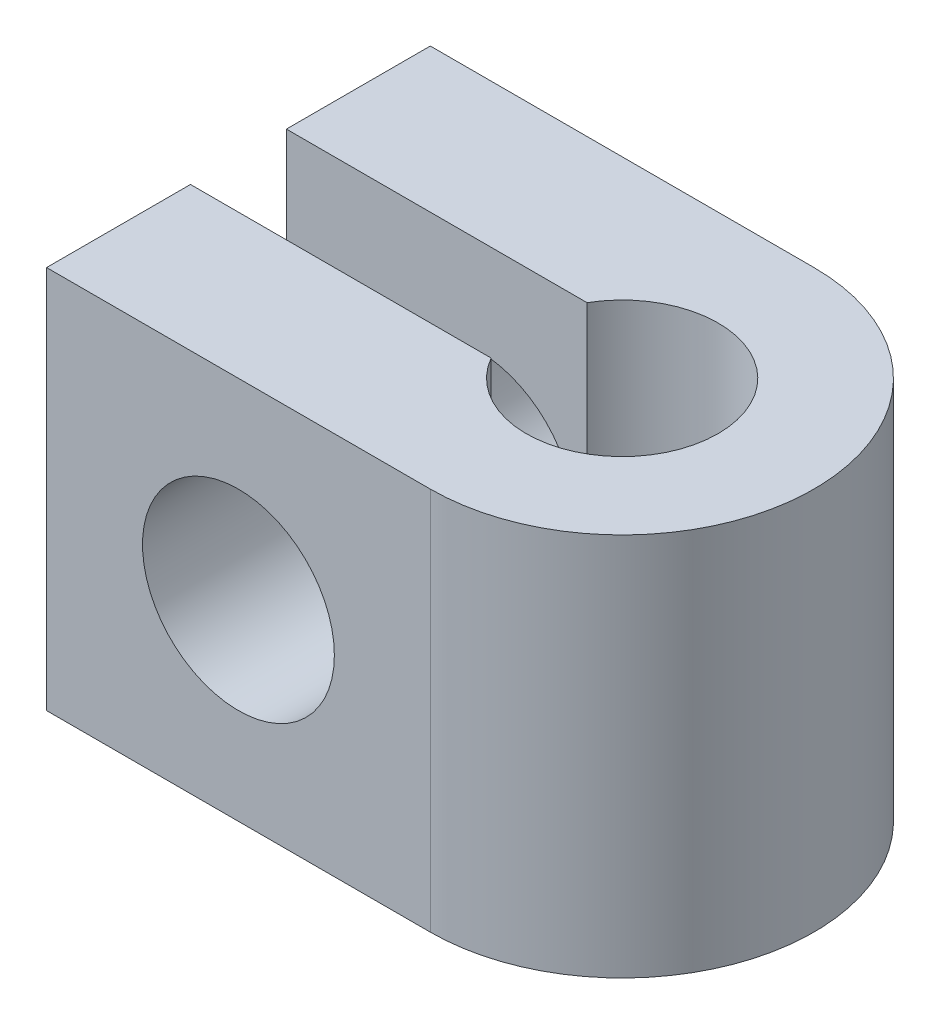
ISO-10303-21;
HEADER;
FILE_DESCRIPTION(('STEP AP214'),'2;1');
FILE_NAME('part.step','',(''),(''),'','','');
FILE_SCHEMA(('AUTOMOTIVE_DESIGN { 1 0 10303 214 1 1 1 1 }'));
ENDSEC;
DATA;
#1=APPLICATION_CONTEXT('core data for automotive mechanical design processes');
#2=APPLICATION_PROTOCOL_DEFINITION('international standard','automotive_design',2000,#1);
#3=PRODUCT_CONTEXT('',#1,'mechanical');
#4=PRODUCT('Part','Part','',(#3));
#5=PRODUCT_RELATED_PRODUCT_CATEGORY('part','',(#4));
#6=PRODUCT_DEFINITION_FORMATION('','',#4);
#7=PRODUCT_DEFINITION_CONTEXT('part definition',#1,'design');
#8=PRODUCT_DEFINITION('design','',#6,#7);
#9=PRODUCT_DEFINITION_SHAPE('','',#8);
#10=(LENGTH_UNIT() NAMED_UNIT(*) SI_UNIT(.MILLI.,.METRE.));
#11=(NAMED_UNIT(*) PLANE_ANGLE_UNIT() SI_UNIT($,.RADIAN.));
#12=(NAMED_UNIT(*) SI_UNIT($,.STERADIAN.) SOLID_ANGLE_UNIT());
#13=UNCERTAINTY_MEASURE_WITH_UNIT(LENGTH_MEASURE(1.E-05),#10,'distance_accuracy_value','');
#14=(GEOMETRIC_REPRESENTATION_CONTEXT(3) GLOBAL_UNCERTAINTY_ASSIGNED_CONTEXT((#13)) GLOBAL_UNIT_ASSIGNED_CONTEXT((#10,
#11,#12)) REPRESENTATION_CONTEXT('',''));
#15=CARTESIAN_POINT('',(0.,0.,0.));
#16=DIRECTION('',(0.,0.,1.));
#17=DIRECTION('',(1.,0.,0.));
#18=AXIS2_PLACEMENT_3D('',#15,#16,#17);
#19=CARTESIAN_POINT('',(0.,12.7,6.35));
#20=DIRECTION('',(0.,-1.,0.));
#21=DIRECTION('',(0.,0.,-1.));
#22=AXIS2_PLACEMENT_3D('',#19,#20,#21);
#23=CYLINDRICAL_SURFACE('',#22,6.35);
#24=CARTESIAN_POINT('',(0.,0.,6.35));
#25=DIRECTION('',(0.,1.,0.));
#26=DIRECTION('',(0.,0.,-1.));
#27=AXIS2_PLACEMENT_3D('',#24,#25,#26);
#28=CIRCLE('',#27,6.35);
#29=CARTESIAN_POINT('',(0.,0.,12.7));
#30=VERTEX_POINT('',#29);
#31=CARTESIAN_POINT('',(0.,0.,0.));
#32=VERTEX_POINT('',#31);
#33=EDGE_CURVE('E126',#30,#32,#28,.T.);
#34=ORIENTED_EDGE('',*,*,#33,.T.);
#35=DIRECTION('',(0.,-1.,0.));
#36=VECTOR('',#35,1.);
#37=CARTESIAN_POINT('',(0.,12.7,0.));
#38=LINE('',#37,#36);
#39=CARTESIAN_POINT('',(0.,12.7,0.));
#40=VERTEX_POINT('',#39);
#41=EDGE_CURVE('E11',#40,#32,#38,.T.);
#42=ORIENTED_EDGE('',*,*,#41,.F.);
#43=CARTESIAN_POINT('',(0.,12.7,6.35));
#44=DIRECTION('',(0.,1.,0.));
#45=DIRECTION('',(0.,0.,-1.));
#46=AXIS2_PLACEMENT_3D('',#43,#44,#45);
#47=CIRCLE('',#46,6.35);
#48=CARTESIAN_POINT('',(0.,12.7,12.7));
#49=VERTEX_POINT('',#48);
#50=EDGE_CURVE('E141',#49,#40,#47,.T.);
#51=ORIENTED_EDGE('',*,*,#50,.F.);
#52=DIRECTION('',(0.,-1.,0.));
#53=VECTOR('',#52,1.);
#54=CARTESIAN_POINT('',(0.,12.7,12.7));
#55=LINE('',#54,#53);
#56=EDGE_CURVE('E122',#49,#30,#55,.T.);
#57=ORIENTED_EDGE('',*,*,#56,.T.);
#58=EDGE_LOOP('',(#34,#42,#51,#57));
#59=FACE_BOUND('',#58,.T.);
#60=ADVANCED_FACE('F30',(#59),#23,.T.);
#61=CARTESIAN_POINT('',(0.,12.7,0.));
#62=DIRECTION('',(0.,0.,1.));
#63=DIRECTION('',(1.,0.,0.));
#64=AXIS2_PLACEMENT_3D('',#61,#62,#63);
#65=PLANE('',#64);
#66=CARTESIAN_POINT('',(-6.35,6.35,0.));
#67=DIRECTION('',(0.,0.,1.));
#68=DIRECTION('',(1.,0.,0.));
#69=AXIS2_PLACEMENT_3D('',#66,#67,#68);
#70=CIRCLE('',#69,3.175);
#71=CARTESIAN_POINT('',(-3.175,6.35,0.));
#72=VERTEX_POINT('',#71);
#73=EDGE_CURVE('E179',#72,#72,#70,.T.);
#74=ORIENTED_EDGE('',*,*,#73,.T.);
#75=EDGE_LOOP('',(#74));
#76=FACE_BOUND('',#75,.T.);
#77=DIRECTION('',(-1.,0.,0.));
#78=VECTOR('',#77,1.);
#79=CARTESIAN_POINT('',(0.,0.,0.));
#80=LINE('',#79,#78);
#81=CARTESIAN_POINT('',(-12.7,0.,0.));
#82=VERTEX_POINT('',#81);
#83=EDGE_CURVE('E129',#32,#82,#80,.T.);
#84=ORIENTED_EDGE('',*,*,#83,.T.);
#85=DIRECTION('',(0.,-1.,0.));
#86=VECTOR('',#85,1.);
#87=CARTESIAN_POINT('',(-12.7,12.7,0.));
#88=LINE('',#87,#86);
#89=CARTESIAN_POINT('',(-12.7,12.7,0.));
#90=VERTEX_POINT('',#89);
#91=EDGE_CURVE('E38',#90,#82,#88,.T.);
#92=ORIENTED_EDGE('',*,*,#91,.F.);
#93=DIRECTION('',(-1.,0.,0.));
#94=VECTOR('',#93,1.);
#95=CARTESIAN_POINT('',(0.,12.7,0.));
#96=LINE('',#95,#94);
#97=EDGE_CURVE('E89',#40,#90,#96,.T.);
#98=ORIENTED_EDGE('',*,*,#97,.F.);
#99=ORIENTED_EDGE('',*,*,#41,.T.);
#100=EDGE_LOOP('',(#84,#92,#98,#99));
#101=FACE_BOUND('',#100,.T.);
#102=ADVANCED_FACE('F186',(#76,#101),#65,.F.);
#103=CARTESIAN_POINT('',(-12.7,12.7,0.));
#104=DIRECTION('',(1.,0.,0.));
#105=DIRECTION('',(0.,0.,-1.));
#106=AXIS2_PLACEMENT_3D('',#103,#104,#105);
#107=PLANE('',#106);
#108=DIRECTION('',(0.,0.,1.));
#109=VECTOR('',#108,1.);
#110=CARTESIAN_POINT('',(-12.7,0.,0.));
#111=LINE('',#110,#109);
#112=CARTESIAN_POINT('',(-12.7,0.,4.7625));
#113=VERTEX_POINT('',#112);
#114=EDGE_CURVE('E132',#82,#113,#111,.T.);
#115=ORIENTED_EDGE('',*,*,#114,.T.);
#116=DIRECTION('',(0.,-1.,0.));
#117=VECTOR('',#116,1.);
#118=CARTESIAN_POINT('',(-12.7,12.7,4.7625));
#119=LINE('',#118,#117);
#120=CARTESIAN_POINT('',(-12.7,12.7,4.7625));
#121=VERTEX_POINT('',#120);
#122=EDGE_CURVE('E148',#121,#113,#119,.T.);
#123=ORIENTED_EDGE('',*,*,#122,.F.);
#124=DIRECTION('',(0.,0.,1.));
#125=VECTOR('',#124,1.);
#126=CARTESIAN_POINT('',(-12.7,12.7,0.));
#127=LINE('',#126,#125);
#128=EDGE_CURVE('E156',#90,#121,#127,.T.);
#129=ORIENTED_EDGE('',*,*,#128,.F.);
#130=ORIENTED_EDGE('',*,*,#91,.T.);
#131=EDGE_LOOP('',(#115,#123,#129,#130));
#132=FACE_BOUND('',#131,.T.);
#133=ADVANCED_FACE('F154',(#132),#107,.F.);
#134=CARTESIAN_POINT('',(-12.7,12.7,4.7625));
#135=DIRECTION('',(0.,0.,-1.));
#136=DIRECTION('',(-1.,0.,0.));
#137=AXIS2_PLACEMENT_3D('',#134,#135,#136);
#138=PLANE('',#137);
#139=CARTESIAN_POINT('',(-6.35,6.35,4.7625));
#140=DIRECTION('',(0.,0.,-1.));
#141=DIRECTION('',(-1.,0.,0.));
#142=AXIS2_PLACEMENT_3D('',#139,#140,#141);
#143=CIRCLE('',#142,3.175);
#144=CARTESIAN_POINT('',(-9.525,6.35,4.7625));
#145=VERTEX_POINT('',#144);
#146=EDGE_CURVE('E130',#145,#145,#143,.T.);
#147=ORIENTED_EDGE('',*,*,#146,.T.);
#148=EDGE_LOOP('',(#147));
#149=FACE_BOUND('',#148,.T.);
#150=DIRECTION('',(1.,0.,0.));
#151=VECTOR('',#150,1.);
#152=CARTESIAN_POINT('',(-12.7,0.,4.7625));
#153=LINE('',#152,#151);
#154=CARTESIAN_POINT('',(-2.74963065701559,0.,4.7625));
#155=VERTEX_POINT('',#154);
#156=EDGE_CURVE('E134',#113,#155,#153,.T.);
#157=ORIENTED_EDGE('',*,*,#156,.T.);
#158=DIRECTION('',(0.,-1.,0.));
#159=VECTOR('',#158,1.);
#160=CARTESIAN_POINT('',(-2.74963065701559,12.7,4.7625));
#161=LINE('',#160,#159);
#162=CARTESIAN_POINT('',(-2.74963065701559,12.7,4.7625));
#163=VERTEX_POINT('',#162);
#164=EDGE_CURVE('E145',#163,#155,#161,.T.);
#165=ORIENTED_EDGE('',*,*,#164,.F.);
#166=DIRECTION('',(1.,0.,0.));
#167=VECTOR('',#166,1.);
#168=CARTESIAN_POINT('',(-12.7,12.7,4.7625));
#169=LINE('',#168,#167);
#170=EDGE_CURVE('E168',#121,#163,#169,.T.);
#171=ORIENTED_EDGE('',*,*,#170,.F.);
#172=ORIENTED_EDGE('',*,*,#122,.T.);
#173=EDGE_LOOP('',(#157,#165,#171,#172));
#174=FACE_BOUND('',#173,.T.);
#175=ADVANCED_FACE('F164',(#149,#174),#138,.F.);
#176=CARTESIAN_POINT('',(0.,12.7,6.35));
#177=DIRECTION('',(0.,-1.,0.));
#178=DIRECTION('',(0.,0.,-1.));
#179=AXIS2_PLACEMENT_3D('',#176,#177,#178);
#180=CYLINDRICAL_SURFACE('',#179,3.175);
#181=CARTESIAN_POINT('',(0.,0.,6.35));
#182=DIRECTION('',(0.,-1.,0.));
#183=DIRECTION('',(0.,0.,-1.));
#184=AXIS2_PLACEMENT_3D('',#181,#182,#183);
#185=CIRCLE('',#184,3.175);
#186=CARTESIAN_POINT('',(-2.74963065701559,0.,7.9375));
#187=VERTEX_POINT('',#186);
#188=EDGE_CURVE('E136',#155,#187,#185,.T.);
#189=ORIENTED_EDGE('',*,*,#188,.T.);
#190=DIRECTION('',(0.,-1.,0.));
#191=VECTOR('',#190,1.);
#192=CARTESIAN_POINT('',(-2.74963065701559,12.7,7.9375));
#193=LINE('',#192,#191);
#194=CARTESIAN_POINT('',(-2.74963065701559,12.7,7.9375));
#195=VERTEX_POINT('',#194);
#196=EDGE_CURVE('E117',#195,#187,#193,.T.);
#197=ORIENTED_EDGE('',*,*,#196,.F.);
#198=CARTESIAN_POINT('',(0.,12.7,6.35));
#199=DIRECTION('',(0.,-1.,0.));
#200=DIRECTION('',(0.,0.,-1.));
#201=AXIS2_PLACEMENT_3D('',#198,#199,#200);
#202=CIRCLE('',#201,3.175);
#203=EDGE_CURVE('E108',#163,#195,#202,.T.);
#204=ORIENTED_EDGE('',*,*,#203,.F.);
#205=ORIENTED_EDGE('',*,*,#164,.T.);
#206=EDGE_LOOP('',(#189,#197,#204,#205));
#207=FACE_BOUND('',#206,.T.);
#208=ADVANCED_FACE('F167',(#207),#180,.F.);
#209=CARTESIAN_POINT('',(-2.74963065701559,12.7,7.9375));
#210=DIRECTION('',(0.,0.,1.));
#211=DIRECTION('',(1.,0.,0.));
#212=AXIS2_PLACEMENT_3D('',#209,#210,#211);
#213=PLANE('',#212);
#214=CARTESIAN_POINT('',(-6.35,6.35,7.9375));
#215=DIRECTION('',(0.,0.,1.));
#216=DIRECTION('',(1.,0.,0.));
#217=AXIS2_PLACEMENT_3D('',#214,#215,#216);
#218=CIRCLE('',#217,3.175);
#219=CARTESIAN_POINT('',(-3.175,6.35,7.9375));
#220=VERTEX_POINT('',#219);
#221=EDGE_CURVE('E176',#220,#220,#218,.T.);
#222=ORIENTED_EDGE('',*,*,#221,.T.);
#223=EDGE_LOOP('',(#222));
#224=FACE_BOUND('',#223,.T.);
#225=DIRECTION('',(-1.,0.,0.));
#226=VECTOR('',#225,1.);
#227=CARTESIAN_POINT('',(-2.74963065701559,0.,7.9375));
#228=LINE('',#227,#226);
#229=CARTESIAN_POINT('',(-12.7,0.,7.9375));
#230=VERTEX_POINT('',#229);
#231=EDGE_CURVE('E116',#187,#230,#228,.T.);
#232=ORIENTED_EDGE('',*,*,#231,.T.);
#233=DIRECTION('',(0.,-1.,0.));
#234=VECTOR('',#233,1.);
#235=CARTESIAN_POINT('',(-12.7,12.7,7.9375));
#236=LINE('',#235,#234);
#237=CARTESIAN_POINT('',(-12.7,12.7,7.9375));
#238=VERTEX_POINT('',#237);
#239=EDGE_CURVE('E113',#238,#230,#236,.T.);
#240=ORIENTED_EDGE('',*,*,#239,.F.);
#241=DIRECTION('',(-1.,0.,0.));
#242=VECTOR('',#241,1.);
#243=CARTESIAN_POINT('',(-2.74963065701559,12.7,7.9375));
#244=LINE('',#243,#242);
#245=EDGE_CURVE('E102',#195,#238,#244,.T.);
#246=ORIENTED_EDGE('',*,*,#245,.F.);
#247=ORIENTED_EDGE('',*,*,#196,.T.);
#248=EDGE_LOOP('',(#232,#240,#246,#247));
#249=FACE_BOUND('',#248,.T.);
#250=ADVANCED_FACE('F114',(#224,#249),#213,.F.);
#251=CARTESIAN_POINT('',(-12.7,12.7,7.9375));
#252=DIRECTION('',(1.,0.,0.));
#253=DIRECTION('',(0.,0.,-1.));
#254=AXIS2_PLACEMENT_3D('',#251,#252,#253);
#255=PLANE('',#254);
#256=DIRECTION('',(0.,0.,1.));
#257=VECTOR('',#256,1.);
#258=CARTESIAN_POINT('',(-12.7,0.,7.9375));
#259=LINE('',#258,#257);
#260=CARTESIAN_POINT('',(-12.7,0.,12.7));
#261=VERTEX_POINT('',#260);
#262=EDGE_CURVE('E75',#230,#261,#259,.T.);
#263=ORIENTED_EDGE('',*,*,#262,.T.);
#264=DIRECTION('',(0.,-1.,0.));
#265=VECTOR('',#264,1.);
#266=CARTESIAN_POINT('',(-12.7,12.7,12.7));
#267=LINE('',#266,#265);
#268=CARTESIAN_POINT('',(-12.7,12.7,12.7));
#269=VERTEX_POINT('',#268);
#270=EDGE_CURVE('E118',#269,#261,#267,.T.);
#271=ORIENTED_EDGE('',*,*,#270,.F.);
#272=DIRECTION('',(0.,0.,1.));
#273=VECTOR('',#272,1.);
#274=CARTESIAN_POINT('',(-12.7,12.7,7.9375));
#275=LINE('',#274,#273);
#276=EDGE_CURVE('E106',#238,#269,#275,.T.);
#277=ORIENTED_EDGE('',*,*,#276,.F.);
#278=ORIENTED_EDGE('',*,*,#239,.T.);
#279=EDGE_LOOP('',(#263,#271,#277,#278));
#280=FACE_BOUND('',#279,.T.);
#281=ADVANCED_FACE('F120',(#280),#255,.F.);
#282=CARTESIAN_POINT('',(-12.7,12.7,12.7));
#283=DIRECTION('',(0.,0.,-1.));
#284=DIRECTION('',(-1.,0.,0.));
#285=AXIS2_PLACEMENT_3D('',#282,#283,#284);
#286=PLANE('',#285);
#287=CARTESIAN_POINT('',(-6.35,6.35,12.7));
#288=DIRECTION('',(0.,0.,1.));
#289=DIRECTION('',(1.,0.,0.));
#290=AXIS2_PLACEMENT_3D('',#287,#288,#289);
#291=CIRCLE('',#290,3.175);
#292=CARTESIAN_POINT('',(-3.175,6.35,12.7));
#293=VERTEX_POINT('',#292);
#294=EDGE_CURVE('E180',#293,#293,#291,.T.);
#295=ORIENTED_EDGE('',*,*,#294,.F.);
#296=EDGE_LOOP('',(#295));
#297=FACE_BOUND('',#296,.T.);
#298=DIRECTION('',(1.,0.,0.));
#299=VECTOR('',#298,1.);
#300=CARTESIAN_POINT('',(-12.7,0.,12.7));
#301=LINE('',#300,#299);
#302=EDGE_CURVE('E81',#261,#30,#301,.T.);
#303=ORIENTED_EDGE('',*,*,#302,.T.);
#304=ORIENTED_EDGE('',*,*,#56,.F.);
#305=DIRECTION('',(1.,0.,0.));
#306=VECTOR('',#305,1.);
#307=CARTESIAN_POINT('',(-12.7,12.7,12.7));
#308=LINE('',#307,#306);
#309=EDGE_CURVE('E46',#269,#49,#308,.T.);
#310=ORIENTED_EDGE('',*,*,#309,.F.);
#311=ORIENTED_EDGE('',*,*,#270,.T.);
#312=EDGE_LOOP('',(#303,#304,#310,#311));
#313=FACE_BOUND('',#312,.T.);
#314=ADVANCED_FACE('F210',(#297,#313),#286,.F.);
#315=CARTESIAN_POINT('',(0.,12.7,6.35));
#316=DIRECTION('',(0.,-1.,0.));
#317=DIRECTION('',(0.,0.,-1.));
#318=AXIS2_PLACEMENT_3D('',#315,#316,#317);
#319=PLANE('',#318);
#320=ORIENTED_EDGE('',*,*,#50,.T.);
#321=ORIENTED_EDGE('',*,*,#97,.T.);
#322=ORIENTED_EDGE('',*,*,#128,.T.);
#323=ORIENTED_EDGE('',*,*,#170,.T.);
#324=ORIENTED_EDGE('',*,*,#203,.T.);
#325=ORIENTED_EDGE('',*,*,#245,.T.);
#326=ORIENTED_EDGE('',*,*,#276,.T.);
#327=ORIENTED_EDGE('',*,*,#309,.T.);
#328=EDGE_LOOP('',(#320,#321,#322,#323,#324,#325,#326,#327));
#329=FACE_BOUND('',#328,.T.);
#330=ADVANCED_FACE('F104',(#329),#319,.F.);
#331=CARTESIAN_POINT('',(0.,0.,6.35));
#332=DIRECTION('',(0.,-1.,0.));
#333=DIRECTION('',(0.,0.,-1.));
#334=AXIS2_PLACEMENT_3D('',#331,#332,#333);
#335=PLANE('',#334);
#336=ORIENTED_EDGE('',*,*,#33,.F.);
#337=ORIENTED_EDGE('',*,*,#302,.F.);
#338=ORIENTED_EDGE('',*,*,#262,.F.);
#339=ORIENTED_EDGE('',*,*,#231,.F.);
#340=ORIENTED_EDGE('',*,*,#188,.F.);
#341=ORIENTED_EDGE('',*,*,#156,.F.);
#342=ORIENTED_EDGE('',*,*,#114,.F.);
#343=ORIENTED_EDGE('',*,*,#83,.F.);
#344=EDGE_LOOP('',(#336,#337,#338,#339,#340,#341,#342,#343));
#345=FACE_BOUND('',#344,.T.);
#346=ADVANCED_FACE('F160',(#345),#335,.T.);
#347=CARTESIAN_POINT('',(-6.35,6.35,0.));
#348=DIRECTION('',(0.,0.,1.));
#349=DIRECTION('',(1.,0.,0.));
#350=AXIS2_PLACEMENT_3D('',#347,#348,#349);
#351=CYLINDRICAL_SURFACE('',#350,3.175);
#352=ORIENTED_EDGE('',*,*,#294,.T.);
#353=EDGE_LOOP('',(#352));
#354=FACE_BOUND('',#353,.T.);
#355=ORIENTED_EDGE('',*,*,#221,.F.);
#356=EDGE_LOOP('',(#355));
#357=FACE_BOUND('',#356,.T.);
#358=ADVANCED_FACE('F191',(#354,#357),#351,.F.);
#359=ORIENTED_EDGE('',*,*,#73,.F.);
#360=EDGE_LOOP('',(#359));
#361=FACE_BOUND('',#360,.T.);
#362=ORIENTED_EDGE('',*,*,#146,.F.);
#363=EDGE_LOOP('',(#362));
#364=FACE_BOUND('',#363,.T.);
#365=ADVANCED_FACE('F188',(#361,#364),#351,.F.);
#366=CLOSED_SHELL('',(#60,#102,#133,#175,#208,#250,#281,#314,#330,#346,#358,#365));
#367=MANIFOLD_SOLID_BREP('B2',#366);
#368=ADVANCED_BREP_SHAPE_REPRESENTATION('',(#18,#367),#14);
#369=SHAPE_DEFINITION_REPRESENTATION(#9,#368);
ENDSEC;
END-ISO-10303-21;
